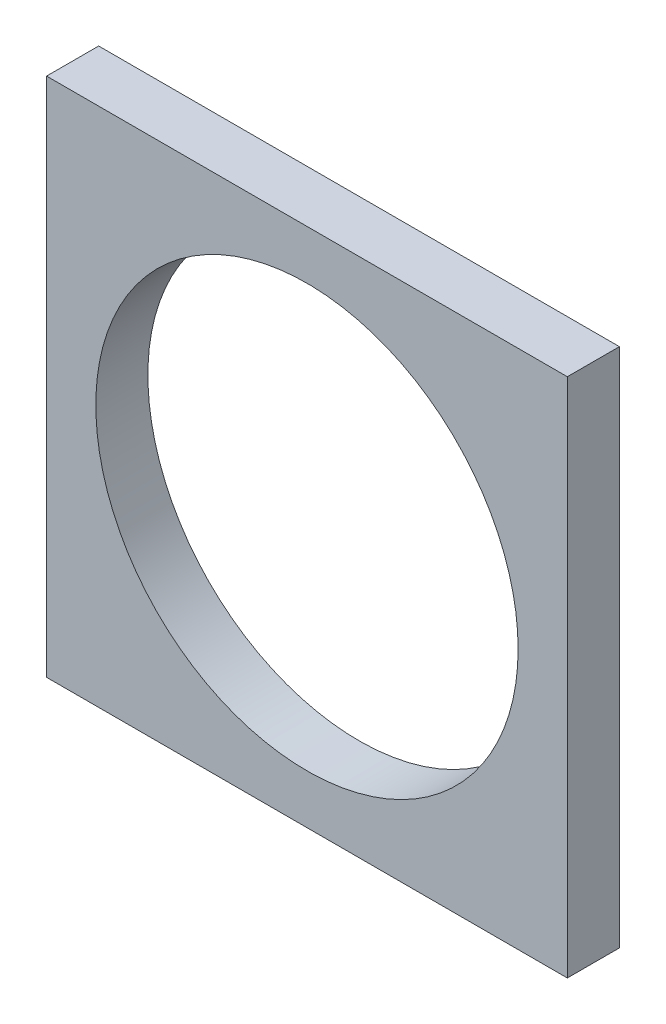
ISO-10303-21;
HEADER;
FILE_DESCRIPTION(('STEP AP214'),'2;1');
FILE_NAME('part.step','',(''),(''),'','','');
FILE_SCHEMA(('AUTOMOTIVE_DESIGN { 1 0 10303 214 1 1 1 1 }'));
ENDSEC;
DATA;
#1=APPLICATION_CONTEXT('core data for automotive mechanical design processes');
#2=APPLICATION_PROTOCOL_DEFINITION('international standard','automotive_design',2000,#1);
#3=PRODUCT_CONTEXT('',#1,'mechanical');
#4=PRODUCT('Part','Part','',(#3));
#5=PRODUCT_RELATED_PRODUCT_CATEGORY('part','',(#4));
#6=PRODUCT_DEFINITION_FORMATION('','',#4);
#7=PRODUCT_DEFINITION_CONTEXT('part definition',#1,'design');
#8=PRODUCT_DEFINITION('design','',#6,#7);
#9=PRODUCT_DEFINITION_SHAPE('','',#8);
#10=(LENGTH_UNIT() NAMED_UNIT(*) SI_UNIT(.MILLI.,.METRE.));
#11=(NAMED_UNIT(*) PLANE_ANGLE_UNIT() SI_UNIT($,.RADIAN.));
#12=(NAMED_UNIT(*) SI_UNIT($,.STERADIAN.) SOLID_ANGLE_UNIT());
#13=UNCERTAINTY_MEASURE_WITH_UNIT(LENGTH_MEASURE(1.E-05),#10,'distance_accuracy_value','');
#14=(GEOMETRIC_REPRESENTATION_CONTEXT(3) GLOBAL_UNCERTAINTY_ASSIGNED_CONTEXT((#13)) GLOBAL_UNIT_ASSIGNED_CONTEXT((#10,
#11,#12)) REPRESENTATION_CONTEXT('',''));
#15=CARTESIAN_POINT('',(0.,0.,0.));
#16=DIRECTION('',(0.,0.,1.));
#17=DIRECTION('',(1.,0.,0.));
#18=AXIS2_PLACEMENT_3D('',#15,#16,#17);
#19=CARTESIAN_POINT('',(63.5,63.5,12.7));
#20=DIRECTION('',(-1.,0.,0.));
#21=DIRECTION('',(0.,-1.,0.));
#22=AXIS2_PLACEMENT_3D('',#19,#20,#21);
#23=PLANE('',#22);
#24=DIRECTION('',(0.,1.,0.));
#25=VECTOR('',#24,1.);
#26=CARTESIAN_POINT('',(63.5,63.5,0.));
#27=LINE('',#26,#25);
#28=CARTESIAN_POINT('',(63.5,-63.5,0.));
#29=VERTEX_POINT('',#28);
#30=CARTESIAN_POINT('',(63.5,63.5,0.));
#31=VERTEX_POINT('',#30);
#32=EDGE_CURVE('E96',#29,#31,#27,.T.);
#33=ORIENTED_EDGE('',*,*,#32,.T.);
#34=DIRECTION('',(0.,0.,-1.));
#35=VECTOR('',#34,1.);
#36=CARTESIAN_POINT('',(63.5,63.5,12.7));
#37=LINE('',#36,#35);
#38=CARTESIAN_POINT('',(63.5,63.5,12.7));
#39=VERTEX_POINT('',#38);
#40=EDGE_CURVE('E11',#39,#31,#37,.T.);
#41=ORIENTED_EDGE('',*,*,#40,.F.);
#42=DIRECTION('',(0.,1.,0.));
#43=VECTOR('',#42,1.);
#44=CARTESIAN_POINT('',(63.5,63.5,12.7));
#45=LINE('',#44,#43);
#46=CARTESIAN_POINT('',(63.5,-63.5,12.7));
#47=VERTEX_POINT('',#46);
#48=EDGE_CURVE('E84',#47,#39,#45,.T.);
#49=ORIENTED_EDGE('',*,*,#48,.F.);
#50=DIRECTION('',(0.,0.,-1.));
#51=VECTOR('',#50,1.);
#52=CARTESIAN_POINT('',(63.5,-63.5,12.7));
#53=LINE('',#52,#51);
#54=EDGE_CURVE('E92',#47,#29,#53,.T.);
#55=ORIENTED_EDGE('',*,*,#54,.T.);
#56=EDGE_LOOP('',(#33,#41,#49,#55));
#57=FACE_BOUND('',#56,.T.);
#58=ADVANCED_FACE('F33',(#57),#23,.F.);
#59=CARTESIAN_POINT('',(-63.5,63.5,12.7));
#60=DIRECTION('',(0.,-1.,0.));
#61=DIRECTION('',(0.,0.,-1.));
#62=AXIS2_PLACEMENT_3D('',#59,#60,#61);
#63=PLANE('',#62);
#64=DIRECTION('',(-1.,0.,0.));
#65=VECTOR('',#64,1.);
#66=CARTESIAN_POINT('',(-63.5,63.5,0.));
#67=LINE('',#66,#65);
#68=CARTESIAN_POINT('',(-63.5,63.5,0.));
#69=VERTEX_POINT('',#68);
#70=EDGE_CURVE('E88',#31,#69,#67,.T.);
#71=ORIENTED_EDGE('',*,*,#70,.T.);
#72=DIRECTION('',(0.,0.,-1.));
#73=VECTOR('',#72,1.);
#74=CARTESIAN_POINT('',(-63.5,63.5,12.7));
#75=LINE('',#74,#73);
#76=CARTESIAN_POINT('',(-63.5,63.5,12.7));
#77=VERTEX_POINT('',#76);
#78=EDGE_CURVE('E41',#77,#69,#75,.T.);
#79=ORIENTED_EDGE('',*,*,#78,.F.);
#80=DIRECTION('',(-1.,0.,0.));
#81=VECTOR('',#80,1.);
#82=CARTESIAN_POINT('',(-63.5,63.5,12.7));
#83=LINE('',#82,#81);
#84=EDGE_CURVE('E79',#39,#77,#83,.T.);
#85=ORIENTED_EDGE('',*,*,#84,.F.);
#86=ORIENTED_EDGE('',*,*,#40,.T.);
#87=EDGE_LOOP('',(#71,#79,#85,#86));
#88=FACE_BOUND('',#87,.T.);
#89=ADVANCED_FACE('F87',(#88),#63,.F.);
#90=CARTESIAN_POINT('',(-63.5,63.5,12.7));
#91=DIRECTION('',(1.,0.,0.));
#92=DIRECTION('',(0.,0.,-1.));
#93=AXIS2_PLACEMENT_3D('',#90,#91,#92);
#94=PLANE('',#93);
#95=DIRECTION('',(0.,-1.,0.));
#96=VECTOR('',#95,1.);
#97=CARTESIAN_POINT('',(-63.5,63.5,0.));
#98=LINE('',#97,#96);
#99=CARTESIAN_POINT('',(-63.5,-63.5,0.));
#100=VERTEX_POINT('',#99);
#101=EDGE_CURVE('E66',#69,#100,#98,.T.);
#102=ORIENTED_EDGE('',*,*,#101,.T.);
#103=DIRECTION('',(0.,0.,-1.));
#104=VECTOR('',#103,1.);
#105=CARTESIAN_POINT('',(-63.5,-63.5,12.7));
#106=LINE('',#105,#104);
#107=CARTESIAN_POINT('',(-63.5,-63.5,12.7));
#108=VERTEX_POINT('',#107);
#109=EDGE_CURVE('E89',#108,#100,#106,.T.);
#110=ORIENTED_EDGE('',*,*,#109,.F.);
#111=DIRECTION('',(0.,-1.,0.));
#112=VECTOR('',#111,1.);
#113=CARTESIAN_POINT('',(-63.5,63.5,12.7));
#114=LINE('',#113,#112);
#115=EDGE_CURVE('E82',#77,#108,#114,.T.);
#116=ORIENTED_EDGE('',*,*,#115,.F.);
#117=ORIENTED_EDGE('',*,*,#78,.T.);
#118=EDGE_LOOP('',(#102,#110,#116,#117));
#119=FACE_BOUND('',#118,.T.);
#120=ADVANCED_FACE('F90',(#119),#94,.F.);
#121=CARTESIAN_POINT('',(-63.5,-63.5,12.7));
#122=DIRECTION('',(0.,1.,0.));
#123=DIRECTION('',(0.,0.,1.));
#124=AXIS2_PLACEMENT_3D('',#121,#122,#123);
#125=PLANE('',#124);
#126=DIRECTION('',(1.,0.,0.));
#127=VECTOR('',#126,1.);
#128=CARTESIAN_POINT('',(-63.5,-63.5,0.));
#129=LINE('',#128,#127);
#130=EDGE_CURVE('E72',#100,#29,#129,.T.);
#131=ORIENTED_EDGE('',*,*,#130,.T.);
#132=ORIENTED_EDGE('',*,*,#54,.F.);
#133=DIRECTION('',(1.,0.,0.));
#134=VECTOR('',#133,1.);
#135=CARTESIAN_POINT('',(-63.5,-63.5,12.7));
#136=LINE('',#135,#134);
#137=EDGE_CURVE('E49',#108,#47,#136,.T.);
#138=ORIENTED_EDGE('',*,*,#137,.F.);
#139=ORIENTED_EDGE('',*,*,#109,.T.);
#140=EDGE_LOOP('',(#131,#132,#138,#139));
#141=FACE_BOUND('',#140,.T.);
#142=ADVANCED_FACE('F104',(#141),#125,.F.);
#143=CARTESIAN_POINT('',(0.,0.,12.7));
#144=DIRECTION('',(0.,0.,1.));
#145=DIRECTION('',(1.,0.,0.));
#146=AXIS2_PLACEMENT_3D('',#143,#144,#145);
#147=PLANE('',#146);
#148=CARTESIAN_POINT('',(0.,0.,12.7));
#149=DIRECTION('',(0.,0.,1.));
#150=DIRECTION('',(1.,0.,0.));
#151=AXIS2_PLACEMENT_3D('',#148,#149,#150);
#152=CIRCLE('',#151,51.5);
#153=CARTESIAN_POINT('',(51.5,0.,12.7));
#154=VERTEX_POINT('',#153);
#155=EDGE_CURVE('E112',#154,#154,#152,.T.);
#156=ORIENTED_EDGE('',*,*,#155,.F.);
#157=EDGE_LOOP('',(#156));
#158=FACE_BOUND('',#157,.T.);
#159=ORIENTED_EDGE('',*,*,#48,.T.);
#160=ORIENTED_EDGE('',*,*,#84,.T.);
#161=ORIENTED_EDGE('',*,*,#115,.T.);
#162=ORIENTED_EDGE('',*,*,#137,.T.);
#163=EDGE_LOOP('',(#159,#160,#161,#162));
#164=FACE_BOUND('',#163,.T.);
#165=ADVANCED_FACE('F80',(#158,#164),#147,.T.);
#166=CARTESIAN_POINT('',(0.,0.,0.));
#167=DIRECTION('',(0.,0.,1.));
#168=DIRECTION('',(1.,0.,0.));
#169=AXIS2_PLACEMENT_3D('',#166,#167,#168);
#170=PLANE('',#169);
#171=CARTESIAN_POINT('',(0.,0.,0.));
#172=DIRECTION('',(0.,0.,1.));
#173=DIRECTION('',(1.,0.,0.));
#174=AXIS2_PLACEMENT_3D('',#171,#172,#173);
#175=CIRCLE('',#174,51.5);
#176=CARTESIAN_POINT('',(51.5,0.,0.));
#177=VERTEX_POINT('',#176);
#178=EDGE_CURVE('E99',#177,#177,#175,.F.);
#179=ORIENTED_EDGE('',*,*,#178,.F.);
#180=EDGE_LOOP('',(#179));
#181=FACE_BOUND('',#180,.T.);
#182=ORIENTED_EDGE('',*,*,#32,.F.);
#183=ORIENTED_EDGE('',*,*,#130,.F.);
#184=ORIENTED_EDGE('',*,*,#101,.F.);
#185=ORIENTED_EDGE('',*,*,#70,.F.);
#186=EDGE_LOOP('',(#182,#183,#184,#185));
#187=FACE_BOUND('',#186,.T.);
#188=ADVANCED_FACE('F107',(#181,#187),#170,.F.);
#189=CARTESIAN_POINT('',(0.,0.,-0.000999999999999265));
#190=DIRECTION('',(0.,0.,1.));
#191=DIRECTION('',(1.,0.,0.));
#192=AXIS2_PLACEMENT_3D('',#189,#190,#191);
#193=CYLINDRICAL_SURFACE('',#192,51.5);
#194=ORIENTED_EDGE('',*,*,#155,.T.);
#195=EDGE_LOOP('',(#194));
#196=FACE_BOUND('',#195,.T.);
#197=ORIENTED_EDGE('',*,*,#178,.T.);
#198=EDGE_LOOP('',(#197));
#199=FACE_BOUND('',#198,.T.);
#200=ADVANCED_FACE('F116',(#196,#199),#193,.F.);
#201=CLOSED_SHELL('',(#58,#89,#120,#142,#165,#188,#200));
#202=MANIFOLD_SOLID_BREP('B2',#201);
#203=ADVANCED_BREP_SHAPE_REPRESENTATION('',(#18,#202),#14);
#204=SHAPE_DEFINITION_REPRESENTATION(#9,#203);
ENDSEC;
END-ISO-10303-21;
